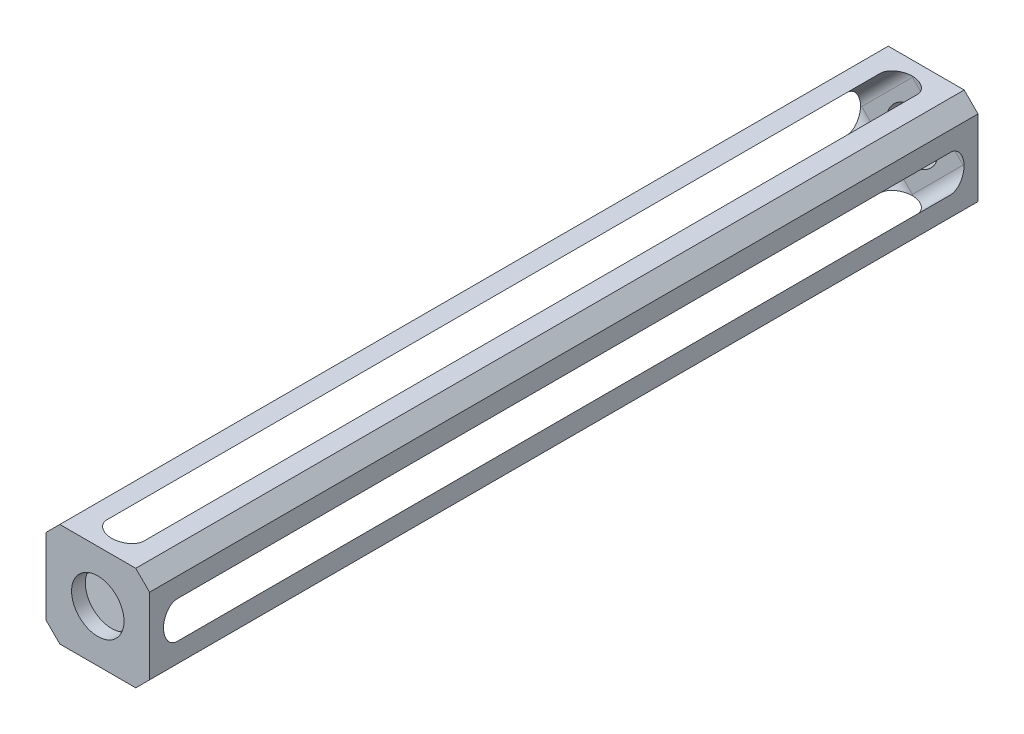
ISO-10303-21;
HEADER;
FILE_DESCRIPTION(('STEP AP214'),'2;1');
FILE_NAME('part.step','',(''),(''),'','','');
FILE_SCHEMA(('AUTOMOTIVE_DESIGN { 1 0 10303 214 1 1 1 1 }'));
ENDSEC;
DATA;
#1=APPLICATION_CONTEXT('core data for automotive mechanical design processes');
#2=APPLICATION_PROTOCOL_DEFINITION('international standard','automotive_design',2000,#1);
#3=PRODUCT_CONTEXT('',#1,'mechanical');
#4=PRODUCT('Part','Part','',(#3));
#5=PRODUCT_RELATED_PRODUCT_CATEGORY('part','',(#4));
#6=PRODUCT_DEFINITION_FORMATION('','',#4);
#7=PRODUCT_DEFINITION_CONTEXT('part definition',#1,'design');
#8=PRODUCT_DEFINITION('design','',#6,#7);
#9=PRODUCT_DEFINITION_SHAPE('','',#8);
#10=(LENGTH_UNIT() NAMED_UNIT(*) SI_UNIT(.MILLI.,.METRE.));
#11=(NAMED_UNIT(*) PLANE_ANGLE_UNIT() SI_UNIT($,.RADIAN.));
#12=(NAMED_UNIT(*) SI_UNIT($,.STERADIAN.) SOLID_ANGLE_UNIT());
#13=UNCERTAINTY_MEASURE_WITH_UNIT(LENGTH_MEASURE(1.E-05),#10,'distance_accuracy_value','');
#14=(GEOMETRIC_REPRESENTATION_CONTEXT(3) GLOBAL_UNCERTAINTY_ASSIGNED_CONTEXT((#13)) GLOBAL_UNIT_ASSIGNED_CONTEXT((#10,
#11,#12)) REPRESENTATION_CONTEXT('',''));
#15=CARTESIAN_POINT('',(0.,0.,0.));
#16=DIRECTION('',(0.,0.,1.));
#17=DIRECTION('',(1.,0.,0.));
#18=AXIS2_PLACEMENT_3D('',#15,#16,#17);
#19=CARTESIAN_POINT('',(-9.525,9.525,76.2));
#20=DIRECTION('',(0.,-1.,0.));
#21=DIRECTION('',(0.,0.,-1.));
#22=AXIS2_PLACEMENT_3D('',#19,#20,#21);
#23=PLANE('',#22);
#24=DIRECTION('',(-1.,0.,0.));
#25=VECTOR('',#24,1.);
#26=CARTESIAN_POINT('',(-9.525,9.525,-76.2));
#27=LINE('',#26,#25);
#28=CARTESIAN_POINT('',(6.98499999999999,9.525,-76.2));
#29=VERTEX_POINT('',#28);
#30=CARTESIAN_POINT('',(-6.98499999999999,9.525,-76.2));
#31=VERTEX_POINT('',#30);
#32=EDGE_CURVE('E235',#29,#31,#27,.T.);
#33=ORIENTED_EDGE('',*,*,#32,.T.);
#34=DIRECTION('',(0.,0.,1.));
#35=VECTOR('',#34,1.);
#36=CARTESIAN_POINT('',(-6.98499999999999,9.525,76.2));
#37=LINE('',#36,#35);
#38=CARTESIAN_POINT('',(-6.98499999999999,9.525,76.2));
#39=VERTEX_POINT('',#38);
#40=EDGE_CURVE('E263',#31,#39,#37,.T.);
#41=ORIENTED_EDGE('',*,*,#40,.T.);
#42=DIRECTION('',(-1.,0.,0.));
#43=VECTOR('',#42,1.);
#44=CARTESIAN_POINT('',(-9.525,9.525,76.2));
#45=LINE('',#44,#43);
#46=CARTESIAN_POINT('',(6.98499999999999,9.525,76.2));
#47=VERTEX_POINT('',#46);
#48=EDGE_CURVE('E233',#47,#39,#45,.T.);
#49=ORIENTED_EDGE('',*,*,#48,.F.);
#50=DIRECTION('',(0.,0.,-1.));
#51=VECTOR('',#50,1.);
#52=CARTESIAN_POINT('',(6.985,9.525,76.2));
#53=LINE('',#52,#51);
#54=EDGE_CURVE('E260',#47,#29,#53,.T.);
#55=ORIENTED_EDGE('',*,*,#54,.T.);
#56=EDGE_LOOP('',(#33,#41,#49,#55));
#57=FACE_BOUND('',#56,.T.);
#58=DIRECTION('',(0.,0.,-1.));
#59=VECTOR('',#58,1.);
#60=CARTESIAN_POINT('',(-3.39289755157231,9.525,76.2));
#61=LINE('',#60,#59);
#62=CARTESIAN_POINT('',(-3.39289755157231,9.525,-71.12));
#63=VERTEX_POINT('',#62);
#64=CARTESIAN_POINT('',(-3.39289755157231,9.525,71.12));
#65=VERTEX_POINT('',#64);
#66=EDGE_CURVE('E401',#63,#65,#61,.F.);
#67=ORIENTED_EDGE('',*,*,#66,.F.);
#68=CARTESIAN_POINT('',(0.199204896855358,9.525,-71.12));
#69=DIRECTION('',(0.,-1.,0.));
#70=DIRECTION('',(-1.,0.,0.));
#71=AXIS2_PLACEMENT_3D('',#68,#69,#70);
#72=ELLIPSE('',#71,3.59210244842767,2.54);
#73=CARTESIAN_POINT('',(0.,9.525,-73.6560912255939));
#74=VERTEX_POINT('',#73);
#75=EDGE_CURVE('E64',#63,#74,#72,.T.);
#76=ORIENTED_EDGE('',*,*,#75,.T.);
#77=CARTESIAN_POINT('',(-0.199204896855304,9.525,-71.12));
#78=DIRECTION('',(0.,-1.,0.));
#79=DIRECTION('',(-1.,0.,0.));
#80=AXIS2_PLACEMENT_3D('',#77,#78,#79);
#81=ELLIPSE('',#80,3.59210244842765,2.54);
#82=CARTESIAN_POINT('',(3.39289755157235,9.525,-71.12));
#83=VERTEX_POINT('',#82);
#84=EDGE_CURVE('E323',#74,#83,#81,.T.);
#85=ORIENTED_EDGE('',*,*,#84,.T.);
#86=DIRECTION('',(0.,0.,1.));
#87=VECTOR('',#86,1.);
#88=CARTESIAN_POINT('',(3.39289755157235,9.525,76.2));
#89=LINE('',#88,#87);
#90=CARTESIAN_POINT('',(3.39289755157235,9.525,71.12));
#91=VERTEX_POINT('',#90);
#92=EDGE_CURVE('E395',#91,#83,#89,.F.);
#93=ORIENTED_EDGE('',*,*,#92,.F.);
#94=CARTESIAN_POINT('',(-0.199204896855304,9.525,71.12));
#95=DIRECTION('',(0.,-1.,0.));
#96=DIRECTION('',(-1.,0.,0.));
#97=AXIS2_PLACEMENT_3D('',#94,#95,#96);
#98=ELLIPSE('',#97,3.59210244842765,2.54);
#99=CARTESIAN_POINT('',(0.,9.525,73.6560912255939));
#100=VERTEX_POINT('',#99);
#101=EDGE_CURVE('E305',#91,#100,#98,.T.);
#102=ORIENTED_EDGE('',*,*,#101,.T.);
#103=CARTESIAN_POINT('',(0.199204896855358,9.525,71.12));
#104=DIRECTION('',(0.,-1.,0.));
#105=DIRECTION('',(-1.,0.,0.));
#106=AXIS2_PLACEMENT_3D('',#103,#104,#105);
#107=ELLIPSE('',#106,3.59210244842767,2.54);
#108=EDGE_CURVE('E303',#100,#65,#107,.T.);
#109=ORIENTED_EDGE('',*,*,#108,.T.);
#110=EDGE_LOOP('',(#67,#76,#85,#93,#102,#109));
#111=FACE_BOUND('',#110,.T.);
#112=ADVANCED_FACE('F40',(#57,#111),#23,.F.);
#113=CARTESIAN_POINT('',(-9.525,9.525,76.2));
#114=DIRECTION('',(1.,0.,0.));
#115=DIRECTION('',(0.,0.,-1.));
#116=AXIS2_PLACEMENT_3D('',#113,#114,#115);
#117=PLANE('',#116);
#118=DIRECTION('',(0.,-1.,0.));
#119=VECTOR('',#118,1.);
#120=CARTESIAN_POINT('',(-9.525,9.525,-76.2));
#121=LINE('',#120,#119);
#122=CARTESIAN_POINT('',(-9.525,6.985,-76.2));
#123=VERTEX_POINT('',#122);
#124=CARTESIAN_POINT('',(-9.525,-6.98499999999996,-76.2));
#125=VERTEX_POINT('',#124);
#126=EDGE_CURVE('E230',#123,#125,#121,.T.);
#127=ORIENTED_EDGE('',*,*,#126,.T.);
#128=DIRECTION('',(0.,0.,1.));
#129=VECTOR('',#128,1.);
#130=CARTESIAN_POINT('',(-9.525,-6.98499999999997,76.2));
#131=LINE('',#130,#129);
#132=CARTESIAN_POINT('',(-9.525,-6.98499999999996,76.2));
#133=VERTEX_POINT('',#132);
#134=EDGE_CURVE('E208',#125,#133,#131,.T.);
#135=ORIENTED_EDGE('',*,*,#134,.T.);
#136=DIRECTION('',(0.,-1.,0.));
#137=VECTOR('',#136,1.);
#138=CARTESIAN_POINT('',(-9.525,9.525,76.2));
#139=LINE('',#138,#137);
#140=CARTESIAN_POINT('',(-9.525,6.985,76.2));
#141=VERTEX_POINT('',#140);
#142=EDGE_CURVE('E407',#141,#133,#139,.T.);
#143=ORIENTED_EDGE('',*,*,#142,.F.);
#144=DIRECTION('',(0.,0.,-1.));
#145=VECTOR('',#144,1.);
#146=CARTESIAN_POINT('',(-9.525,6.985,76.2));
#147=LINE('',#146,#145);
#148=EDGE_CURVE('E213',#141,#123,#147,.T.);
#149=ORIENTED_EDGE('',*,*,#148,.T.);
#150=EDGE_LOOP('',(#127,#135,#143,#149));
#151=FACE_BOUND('',#150,.T.);
#152=DIRECTION('',(0.,0.,-1.));
#153=VECTOR('',#152,1.);
#154=CARTESIAN_POINT('',(-9.525,-3.3928975515723,76.2));
#155=LINE('',#154,#153);
#156=CARTESIAN_POINT('',(-9.525,-3.3928975515723,-71.12));
#157=VERTEX_POINT('',#156);
#158=CARTESIAN_POINT('',(-9.525,-3.3928975515723,71.12));
#159=VERTEX_POINT('',#158);
#160=EDGE_CURVE('E386',#157,#159,#155,.F.);
#161=ORIENTED_EDGE('',*,*,#160,.F.);
#162=CARTESIAN_POINT('',(-9.525,0.199204896855371,-71.12));
#163=DIRECTION('',(1.,0.,0.));
#164=DIRECTION('',(0.,-1.,0.));
#165=AXIS2_PLACEMENT_3D('',#162,#163,#164);
#166=ELLIPSE('',#165,3.59210244842767,2.54);
#167=CARTESIAN_POINT('',(-9.525,0.,-73.6560912255939));
#168=VERTEX_POINT('',#167);
#169=EDGE_CURVE('E49',#157,#168,#166,.T.);
#170=ORIENTED_EDGE('',*,*,#169,.T.);
#171=CARTESIAN_POINT('',(-9.525,-0.199204896855302,-71.12));
#172=DIRECTION('',(1.,0.,0.));
#173=DIRECTION('',(0.,-1.,0.));
#174=AXIS2_PLACEMENT_3D('',#171,#172,#173);
#175=ELLIPSE('',#174,3.59210244842765,2.54);
#176=CARTESIAN_POINT('',(-9.525,3.39289755157235,-71.12));
#177=VERTEX_POINT('',#176);
#178=EDGE_CURVE('E326',#168,#177,#175,.T.);
#179=ORIENTED_EDGE('',*,*,#178,.T.);
#180=DIRECTION('',(0.,0.,1.));
#181=VECTOR('',#180,1.);
#182=CARTESIAN_POINT('',(-9.525,3.39289755157235,76.2));
#183=LINE('',#182,#181);
#184=CARTESIAN_POINT('',(-9.525,3.39289755157235,71.12));
#185=VERTEX_POINT('',#184);
#186=EDGE_CURVE('E383',#185,#177,#183,.F.);
#187=ORIENTED_EDGE('',*,*,#186,.F.);
#188=CARTESIAN_POINT('',(-9.525,-0.199204896855302,71.12));
#189=DIRECTION('',(1.,0.,0.));
#190=DIRECTION('',(0.,-1.,0.));
#191=AXIS2_PLACEMENT_3D('',#188,#189,#190);
#192=ELLIPSE('',#191,3.59210244842765,2.54);
#193=CARTESIAN_POINT('',(-9.525,0.,73.6560912255939));
#194=VERTEX_POINT('',#193);
#195=EDGE_CURVE('E301',#185,#194,#192,.T.);
#196=ORIENTED_EDGE('',*,*,#195,.T.);
#197=CARTESIAN_POINT('',(-9.525,0.199204896855371,71.12));
#198=DIRECTION('',(1.,0.,0.));
#199=DIRECTION('',(0.,-1.,0.));
#200=AXIS2_PLACEMENT_3D('',#197,#198,#199);
#201=ELLIPSE('',#200,3.59210244842767,2.54);
#202=EDGE_CURVE('E315',#194,#159,#201,.T.);
#203=ORIENTED_EDGE('',*,*,#202,.T.);
#204=EDGE_LOOP('',(#161,#170,#179,#187,#196,#203));
#205=FACE_BOUND('',#204,.T.);
#206=ADVANCED_FACE('F426',(#151,#205),#117,.F.);
#207=CARTESIAN_POINT('',(9.525,9.525,76.2));
#208=DIRECTION('',(-1.,0.,0.));
#209=DIRECTION('',(0.,-1.,0.));
#210=AXIS2_PLACEMENT_3D('',#207,#208,#209);
#211=PLANE('',#210);
#212=DIRECTION('',(0.,0.,1.));
#213=VECTOR('',#212,1.);
#214=CARTESIAN_POINT('',(9.525,-3.39289755157233,76.2));
#215=LINE('',#214,#213);
#216=CARTESIAN_POINT('',(9.525,-3.39289755157233,71.12));
#217=VERTEX_POINT('',#216);
#218=CARTESIAN_POINT('',(9.525,-3.39289755157233,-71.12));
#219=VERTEX_POINT('',#218);
#220=EDGE_CURVE('E392',#217,#219,#215,.F.);
#221=ORIENTED_EDGE('',*,*,#220,.F.);
#222=CARTESIAN_POINT('',(9.525,0.199204896855316,71.12));
#223=DIRECTION('',(-1.,0.,0.));
#224=DIRECTION('',(0.,1.,0.));
#225=AXIS2_PLACEMENT_3D('',#222,#223,#224);
#226=ELLIPSE('',#225,3.59210244842765,2.54);
#227=CARTESIAN_POINT('',(9.525,0.,73.6560912255939));
#228=VERTEX_POINT('',#227);
#229=EDGE_CURVE('E309',#217,#228,#226,.T.);
#230=ORIENTED_EDGE('',*,*,#229,.T.);
#231=CARTESIAN_POINT('',(9.525,-0.199204896855358,71.12));
#232=DIRECTION('',(-1.,0.,0.));
#233=DIRECTION('',(0.,1.,0.));
#234=AXIS2_PLACEMENT_3D('',#231,#232,#233);
#235=ELLIPSE('',#234,3.59210244842767,2.54);
#236=CARTESIAN_POINT('',(9.525,3.39289755157232,71.12));
#237=VERTEX_POINT('',#236);
#238=EDGE_CURVE('E307',#228,#237,#235,.T.);
#239=ORIENTED_EDGE('',*,*,#238,.T.);
#240=DIRECTION('',(0.,0.,-1.));
#241=VECTOR('',#240,1.);
#242=CARTESIAN_POINT('',(9.525,3.39289755157232,76.2));
#243=LINE('',#242,#241);
#244=CARTESIAN_POINT('',(9.525,3.39289755157232,-71.12));
#245=VERTEX_POINT('',#244);
#246=EDGE_CURVE('E396',#245,#237,#243,.F.);
#247=ORIENTED_EDGE('',*,*,#246,.F.);
#248=CARTESIAN_POINT('',(9.525,-0.199204896855358,-71.12));
#249=DIRECTION('',(-1.,0.,0.));
#250=DIRECTION('',(0.,1.,0.));
#251=AXIS2_PLACEMENT_3D('',#248,#249,#250);
#252=ELLIPSE('',#251,3.59210244842767,2.54);
#253=CARTESIAN_POINT('',(9.525,0.,-73.6560912255939));
#254=VERTEX_POINT('',#253);
#255=EDGE_CURVE('E321',#245,#254,#252,.T.);
#256=ORIENTED_EDGE('',*,*,#255,.T.);
#257=CARTESIAN_POINT('',(9.525,0.199204896855316,-71.12));
#258=DIRECTION('',(-1.,0.,0.));
#259=DIRECTION('',(0.,1.,0.));
#260=AXIS2_PLACEMENT_3D('',#257,#258,#259);
#261=ELLIPSE('',#260,3.59210244842765,2.54);
#262=EDGE_CURVE('E319',#254,#219,#261,.T.);
#263=ORIENTED_EDGE('',*,*,#262,.T.);
#264=EDGE_LOOP('',(#221,#230,#239,#247,#256,#263));
#265=FACE_BOUND('',#264,.T.);
#266=DIRECTION('',(0.,1.,0.));
#267=VECTOR('',#266,1.);
#268=CARTESIAN_POINT('',(9.525,9.525,76.2));
#269=LINE('',#268,#267);
#270=CARTESIAN_POINT('',(9.525,-6.98499999999998,76.2));
#271=VERTEX_POINT('',#270);
#272=CARTESIAN_POINT('',(9.525,6.98499999999999,76.2));
#273=VERTEX_POINT('',#272);
#274=EDGE_CURVE('E229',#271,#273,#269,.T.);
#275=ORIENTED_EDGE('',*,*,#274,.F.);
#276=DIRECTION('',(0.,0.,-1.));
#277=VECTOR('',#276,1.);
#278=CARTESIAN_POINT('',(9.525,-6.98499999999998,76.2));
#279=LINE('',#278,#277);
#280=CARTESIAN_POINT('',(9.525,-6.98499999999998,-76.2));
#281=VERTEX_POINT('',#280);
#282=EDGE_CURVE('E257',#271,#281,#279,.T.);
#283=ORIENTED_EDGE('',*,*,#282,.T.);
#284=DIRECTION('',(0.,1.,0.));
#285=VECTOR('',#284,1.);
#286=CARTESIAN_POINT('',(9.525,9.525,-76.2));
#287=LINE('',#286,#285);
#288=CARTESIAN_POINT('',(9.525,6.98499999999999,-76.2));
#289=VERTEX_POINT('',#288);
#290=EDGE_CURVE('E403',#281,#289,#287,.T.);
#291=ORIENTED_EDGE('',*,*,#290,.T.);
#292=DIRECTION('',(0.,0.,1.));
#293=VECTOR('',#292,1.);
#294=CARTESIAN_POINT('',(9.525,6.98499999999999,76.2));
#295=LINE('',#294,#293);
#296=EDGE_CURVE('E255',#289,#273,#295,.T.);
#297=ORIENTED_EDGE('',*,*,#296,.T.);
#298=EDGE_LOOP('',(#275,#283,#291,#297));
#299=FACE_BOUND('',#298,.T.);
#300=ADVANCED_FACE('F428',(#265,#299),#211,.F.);
#301=CARTESIAN_POINT('',(-9.525,-9.525,76.2));
#302=DIRECTION('',(0.,1.,0.));
#303=DIRECTION('',(0.,0.,1.));
#304=AXIS2_PLACEMENT_3D('',#301,#302,#303);
#305=PLANE('',#304);
#306=DIRECTION('',(0.,0.,1.));
#307=VECTOR('',#306,1.);
#308=CARTESIAN_POINT('',(-3.39289755157233,-9.525,76.2));
#309=LINE('',#308,#307);
#310=CARTESIAN_POINT('',(-3.39289755157233,-9.525,71.12));
#311=VERTEX_POINT('',#310);
#312=CARTESIAN_POINT('',(-3.39289755157233,-9.525,-71.12));
#313=VERTEX_POINT('',#312);
#314=EDGE_CURVE('E376',#311,#313,#309,.F.);
#315=ORIENTED_EDGE('',*,*,#314,.F.);
#316=CARTESIAN_POINT('',(0.199204896855316,-9.525,71.12));
#317=DIRECTION('',(0.,1.,0.));
#318=DIRECTION('',(1.,0.,0.));
#319=AXIS2_PLACEMENT_3D('',#316,#317,#318);
#320=ELLIPSE('',#319,3.59210244842765,2.54);
#321=CARTESIAN_POINT('',(0.,-9.525,73.6560912255939));
#322=VERTEX_POINT('',#321);
#323=EDGE_CURVE('E313',#311,#322,#320,.T.);
#324=ORIENTED_EDGE('',*,*,#323,.T.);
#325=CARTESIAN_POINT('',(-0.199204896855366,-9.525,71.12));
#326=DIRECTION('',(0.,1.,0.));
#327=DIRECTION('',(1.,0.,0.));
#328=AXIS2_PLACEMENT_3D('',#325,#326,#327);
#329=ELLIPSE('',#328,3.59210244842767,2.54);
#330=CARTESIAN_POINT('',(3.3928975515723,-9.525,71.12));
#331=VERTEX_POINT('',#330);
#332=EDGE_CURVE('E311',#322,#331,#329,.T.);
#333=ORIENTED_EDGE('',*,*,#332,.T.);
#334=DIRECTION('',(0.,0.,-1.));
#335=VECTOR('',#334,1.);
#336=CARTESIAN_POINT('',(3.3928975515723,-9.525,76.2));
#337=LINE('',#336,#335);
#338=CARTESIAN_POINT('',(3.3928975515723,-9.525,-71.12));
#339=VERTEX_POINT('',#338);
#340=EDGE_CURVE('E341',#339,#331,#337,.F.);
#341=ORIENTED_EDGE('',*,*,#340,.F.);
#342=CARTESIAN_POINT('',(-0.199204896855366,-9.525,-71.12));
#343=DIRECTION('',(0.,1.,0.));
#344=DIRECTION('',(1.,0.,0.));
#345=AXIS2_PLACEMENT_3D('',#342,#343,#344);
#346=ELLIPSE('',#345,3.59210244842767,2.54);
#347=CARTESIAN_POINT('',(0.,-9.525,-73.6560912255939));
#348=VERTEX_POINT('',#347);
#349=EDGE_CURVE('E317',#339,#348,#346,.T.);
#350=ORIENTED_EDGE('',*,*,#349,.T.);
#351=CARTESIAN_POINT('',(0.199204896855316,-9.525,-71.12));
#352=DIRECTION('',(0.,1.,0.));
#353=DIRECTION('',(1.,0.,0.));
#354=AXIS2_PLACEMENT_3D('',#351,#352,#353);
#355=ELLIPSE('',#354,3.59210244842765,2.54);
#356=EDGE_CURVE('E11',#348,#313,#355,.T.);
#357=ORIENTED_EDGE('',*,*,#356,.T.);
#358=EDGE_LOOP('',(#315,#324,#333,#341,#350,#357));
#359=FACE_BOUND('',#358,.T.);
#360=DIRECTION('',(1.,0.,0.));
#361=VECTOR('',#360,1.);
#362=CARTESIAN_POINT('',(-9.525,-9.525,76.2));
#363=LINE('',#362,#361);
#364=CARTESIAN_POINT('',(-6.98499999999999,-9.525,76.2));
#365=VERTEX_POINT('',#364);
#366=CARTESIAN_POINT('',(6.98499999999998,-9.525,76.2));
#367=VERTEX_POINT('',#366);
#368=EDGE_CURVE('E223',#365,#367,#363,.T.);
#369=ORIENTED_EDGE('',*,*,#368,.F.);
#370=DIRECTION('',(0.,0.,-1.));
#371=VECTOR('',#370,1.);
#372=CARTESIAN_POINT('',(-6.98499999999999,-9.525,76.2));
#373=LINE('',#372,#371);
#374=CARTESIAN_POINT('',(-6.98499999999999,-9.525,-76.2));
#375=VERTEX_POINT('',#374);
#376=EDGE_CURVE('E207',#365,#375,#373,.T.);
#377=ORIENTED_EDGE('',*,*,#376,.T.);
#378=DIRECTION('',(1.,0.,0.));
#379=VECTOR('',#378,1.);
#380=CARTESIAN_POINT('',(-9.525,-9.525,-76.2));
#381=LINE('',#380,#379);
#382=CARTESIAN_POINT('',(6.98499999999998,-9.525,-76.2));
#383=VERTEX_POINT('',#382);
#384=EDGE_CURVE('E220',#375,#383,#381,.T.);
#385=ORIENTED_EDGE('',*,*,#384,.T.);
#386=DIRECTION('',(0.,0.,1.));
#387=VECTOR('',#386,1.);
#388=CARTESIAN_POINT('',(6.98499999999998,-9.525,76.2));
#389=LINE('',#388,#387);
#390=EDGE_CURVE('E225',#383,#367,#389,.T.);
#391=ORIENTED_EDGE('',*,*,#390,.T.);
#392=EDGE_LOOP('',(#369,#377,#385,#391));
#393=FACE_BOUND('',#392,.T.);
#394=ADVANCED_FACE('F219',(#359,#393),#305,.F.);
#395=CARTESIAN_POINT('',(0.,0.,76.2));
#396=DIRECTION('',(0.,0.,1.));
#397=DIRECTION('',(1.,0.,0.));
#398=AXIS2_PLACEMENT_3D('',#395,#396,#397);
#399=PLANE('',#398);
#400=CARTESIAN_POINT('',(0.,0.,76.2));
#401=DIRECTION('',(0.,0.,1.));
#402=DIRECTION('',(1.,0.,0.));
#403=AXIS2_PLACEMENT_3D('',#400,#401,#402);
#404=CIRCLE('',#403,4.826);
#405=CARTESIAN_POINT('',(4.826,0.,76.2));
#406=VERTEX_POINT('',#405);
#407=EDGE_CURVE('E592',#406,#406,#404,.T.);
#408=ORIENTED_EDGE('',*,*,#407,.F.);
#409=EDGE_LOOP('',(#408));
#410=FACE_BOUND('',#409,.T.);
#411=ORIENTED_EDGE('',*,*,#142,.T.);
#412=DIRECTION('',(-0.707106781186546,0.707106781186549,0.));
#413=VECTOR('',#412,1.);
#414=CARTESIAN_POINT('',(-8.25500000000001,-8.25499999999997,76.2));
#415=LINE('',#414,#413);
#416=EDGE_CURVE('E253',#133,#365,#415,.F.);
#417=ORIENTED_EDGE('',*,*,#416,.T.);
#418=ORIENTED_EDGE('',*,*,#368,.T.);
#419=DIRECTION('',(-0.707106781186549,-0.707106781186546,0.));
#420=VECTOR('',#419,1.);
#421=CARTESIAN_POINT('',(8.25499999999997,-8.25500000000001,76.2));
#422=LINE('',#421,#420);
#423=EDGE_CURVE('E251',#367,#271,#422,.F.);
#424=ORIENTED_EDGE('',*,*,#423,.T.);
#425=ORIENTED_EDGE('',*,*,#274,.T.);
#426=DIRECTION('',(0.707106781186546,-0.70710678118655,0.));
#427=VECTOR('',#426,1.);
#428=CARTESIAN_POINT('',(8.25500000000002,8.25499999999998,76.2));
#429=LINE('',#428,#427);
#430=EDGE_CURVE('E247',#273,#47,#429,.F.);
#431=ORIENTED_EDGE('',*,*,#430,.T.);
#432=ORIENTED_EDGE('',*,*,#48,.T.);
#433=DIRECTION('',(0.70710678118655,0.707106781186546,0.));
#434=VECTOR('',#433,1.);
#435=CARTESIAN_POINT('',(-8.25499999999998,8.25500000000002,76.2));
#436=LINE('',#435,#434);
#437=EDGE_CURVE('E249',#39,#141,#436,.F.);
#438=ORIENTED_EDGE('',*,*,#437,.T.);
#439=EDGE_LOOP('',(#411,#417,#418,#424,#425,#431,#432,#438));
#440=FACE_BOUND('',#439,.T.);
#441=ADVANCED_FACE('F424',(#410,#440),#399,.T.);
#442=CARTESIAN_POINT('',(0.,0.,-76.2));
#443=DIRECTION('',(0.,0.,1.));
#444=DIRECTION('',(1.,0.,0.));
#445=AXIS2_PLACEMENT_3D('',#442,#443,#444);
#446=PLANE('',#445);
#447=CARTESIAN_POINT('',(0.,0.,-76.2));
#448=DIRECTION('',(0.,0.,1.));
#449=DIRECTION('',(1.,0.,0.));
#450=AXIS2_PLACEMENT_3D('',#447,#448,#449);
#451=CIRCLE('',#450,4.826);
#452=CARTESIAN_POINT('',(4.826,0.,-76.2));
#453=VERTEX_POINT('',#452);
#454=EDGE_CURVE('E596',#453,#453,#451,.T.);
#455=ORIENTED_EDGE('',*,*,#454,.T.);
#456=EDGE_LOOP('',(#455));
#457=FACE_BOUND('',#456,.T.);
#458=ORIENTED_EDGE('',*,*,#384,.F.);
#459=DIRECTION('',(0.707106781186546,-0.707106781186549,0.));
#460=VECTOR('',#459,1.);
#461=CARTESIAN_POINT('',(-6.98499999999999,-9.525,-76.2));
#462=LINE('',#461,#460);
#463=EDGE_CURVE('E203',#375,#125,#462,.F.);
#464=ORIENTED_EDGE('',*,*,#463,.T.);
#465=ORIENTED_EDGE('',*,*,#126,.F.);
#466=DIRECTION('',(-0.70710678118655,-0.707106781186546,0.));
#467=VECTOR('',#466,1.);
#468=CARTESIAN_POINT('',(-9.525,6.985,-76.2));
#469=LINE('',#468,#467);
#470=EDGE_CURVE('E241',#123,#31,#469,.F.);
#471=ORIENTED_EDGE('',*,*,#470,.T.);
#472=ORIENTED_EDGE('',*,*,#32,.F.);
#473=DIRECTION('',(-0.707106781186546,0.70710678118655,0.));
#474=VECTOR('',#473,1.);
#475=CARTESIAN_POINT('',(6.985,9.525,-76.2));
#476=LINE('',#475,#474);
#477=EDGE_CURVE('E224',#29,#289,#476,.F.);
#478=ORIENTED_EDGE('',*,*,#477,.T.);
#479=ORIENTED_EDGE('',*,*,#290,.F.);
#480=DIRECTION('',(0.707106781186549,0.707106781186546,0.));
#481=VECTOR('',#480,1.);
#482=CARTESIAN_POINT('',(9.525,-6.98499999999998,-76.2));
#483=LINE('',#482,#481);
#484=EDGE_CURVE('E214',#281,#383,#483,.F.);
#485=ORIENTED_EDGE('',*,*,#484,.T.);
#486=EDGE_LOOP('',(#458,#464,#465,#471,#472,#478,#479,#485));
#487=FACE_BOUND('',#486,.T.);
#488=ADVANCED_FACE('F227',(#457,#487),#446,.F.);
#489=CARTESIAN_POINT('',(-6.98499999999999,-9.525,76.2));
#490=DIRECTION('',(0.707106781186549,0.707106781186545,0.));
#491=DIRECTION('',(0.,0.,-1.));
#492=AXIS2_PLACEMENT_3D('',#489,#490,#491);
#493=PLANE('',#492);
#494=ORIENTED_EDGE('',*,*,#416,.F.);
#495=ORIENTED_EDGE('',*,*,#134,.F.);
#496=ORIENTED_EDGE('',*,*,#463,.F.);
#497=ORIENTED_EDGE('',*,*,#376,.F.);
#498=EDGE_LOOP('',(#494,#495,#496,#497));
#499=FACE_BOUND('',#498,.T.);
#500=ADVANCED_FACE('F206',(#499),#493,.F.);
#501=CARTESIAN_POINT('',(9.525,-6.98499999999998,76.2));
#502=DIRECTION('',(-0.707106781186545,0.707106781186549,0.));
#503=DIRECTION('',(0.,0.,-1.));
#504=AXIS2_PLACEMENT_3D('',#501,#502,#503);
#505=PLANE('',#504);
#506=ORIENTED_EDGE('',*,*,#423,.F.);
#507=ORIENTED_EDGE('',*,*,#390,.F.);
#508=ORIENTED_EDGE('',*,*,#484,.F.);
#509=ORIENTED_EDGE('',*,*,#282,.F.);
#510=EDGE_LOOP('',(#506,#507,#508,#509));
#511=FACE_BOUND('',#510,.T.);
#512=ADVANCED_FACE('F495',(#511),#505,.F.);
#513=CARTESIAN_POINT('',(-9.525,6.985,76.2));
#514=DIRECTION('',(0.707106781186546,-0.70710678118655,0.));
#515=DIRECTION('',(0.,0.,-1.));
#516=AXIS2_PLACEMENT_3D('',#513,#514,#515);
#517=PLANE('',#516);
#518=ORIENTED_EDGE('',*,*,#437,.F.);
#519=ORIENTED_EDGE('',*,*,#40,.F.);
#520=ORIENTED_EDGE('',*,*,#470,.F.);
#521=ORIENTED_EDGE('',*,*,#148,.F.);
#522=EDGE_LOOP('',(#518,#519,#520,#521));
#523=FACE_BOUND('',#522,.T.);
#524=ADVANCED_FACE('F420',(#523),#517,.F.);
#525=CARTESIAN_POINT('',(6.985,9.525,76.2));
#526=DIRECTION('',(-0.70710678118655,-0.707106781186546,0.));
#527=DIRECTION('',(0.,0.,-1.));
#528=AXIS2_PLACEMENT_3D('',#525,#526,#527);
#529=PLANE('',#528);
#530=ORIENTED_EDGE('',*,*,#430,.F.);
#531=ORIENTED_EDGE('',*,*,#296,.F.);
#532=ORIENTED_EDGE('',*,*,#477,.F.);
#533=ORIENTED_EDGE('',*,*,#54,.F.);
#534=EDGE_LOOP('',(#530,#531,#532,#533));
#535=FACE_BOUND('',#534,.T.);
#536=ADVANCED_FACE('F472',(#535),#529,.F.);
#537=CARTESIAN_POINT('',(0.,0.,73.66));
#538=DIRECTION('',(0.,0.,1.));
#539=DIRECTION('',(1.,0.,0.));
#540=AXIS2_PLACEMENT_3D('',#537,#538,#539);
#541=PLANE('',#540);
#542=CARTESIAN_POINT('',(0.,0.,73.66));
#543=DIRECTION('',(0.,0.,1.));
#544=DIRECTION('',(1.,0.,0.));
#545=AXIS2_PLACEMENT_3D('',#542,#543,#544);
#546=CIRCLE('',#545,4.826);
#547=CARTESIAN_POINT('',(4.826,0.,73.66));
#548=VERTEX_POINT('',#547);
#549=EDGE_CURVE('E346',#548,#548,#546,.T.);
#550=ORIENTED_EDGE('',*,*,#549,.T.);
#551=EDGE_LOOP('',(#550));
#552=FACE_BOUND('',#551,.T.);
#553=DIRECTION('',(-0.707106781186546,0.707106781186549,0.));
#554=VECTOR('',#553,1.);
#555=CARTESIAN_POINT('',(-7.72894877578617,-1.59684632735847,73.66));
#556=LINE('',#555,#554);
#557=CARTESIAN_POINT('',(0.,-9.32579510314466,73.66));
#558=VERTEX_POINT('',#557);
#559=CARTESIAN_POINT('',(-9.32579510314466,0.,73.66));
#560=VERTEX_POINT('',#559);
#561=EDGE_CURVE('E270',#558,#560,#556,.T.);
#562=ORIENTED_EDGE('',*,*,#561,.T.);
#563=DIRECTION('',(0.70710678118655,0.707106781186546,0.));
#564=VECTOR('',#563,1.);
#565=CARTESIAN_POINT('',(-1.59684632735849,7.72894877578617,73.66));
#566=LINE('',#565,#564);
#567=CARTESIAN_POINT('',(0.,9.32579510314467,73.66));
#568=VERTEX_POINT('',#567);
#569=EDGE_CURVE('E276',#560,#568,#566,.T.);
#570=ORIENTED_EDGE('',*,*,#569,.T.);
#571=DIRECTION('',(0.707106781186546,-0.70710678118655,0.));
#572=VECTOR('',#571,1.);
#573=CARTESIAN_POINT('',(7.72894877578617,1.59684632735849,73.66));
#574=LINE('',#573,#572);
#575=CARTESIAN_POINT('',(9.32579510314466,0.,73.66));
#576=VERTEX_POINT('',#575);
#577=EDGE_CURVE('E274',#568,#576,#574,.T.);
#578=ORIENTED_EDGE('',*,*,#577,.T.);
#579=DIRECTION('',(-0.707106781186549,-0.707106781186546,0.));
#580=VECTOR('',#579,1.);
#581=CARTESIAN_POINT('',(1.59684632735848,-7.72894877578616,73.66));
#582=LINE('',#581,#580);
#583=EDGE_CURVE('E272',#576,#558,#582,.T.);
#584=ORIENTED_EDGE('',*,*,#583,.T.);
#585=EDGE_LOOP('',(#562,#570,#578,#584));
#586=FACE_BOUND('',#585,.T.);
#587=ADVANCED_FACE('F470',(#552,#586),#541,.F.);
#588=CARTESIAN_POINT('',(0.,0.,-73.66));
#589=DIRECTION('',(0.,0.,1.));
#590=DIRECTION('',(1.,0.,0.));
#591=AXIS2_PLACEMENT_3D('',#588,#589,#590);
#592=PLANE('',#591);
#593=CARTESIAN_POINT('',(0.,0.,-73.66));
#594=DIRECTION('',(0.,0.,1.));
#595=DIRECTION('',(1.,0.,0.));
#596=AXIS2_PLACEMENT_3D('',#593,#594,#595);
#597=CIRCLE('',#596,4.826);
#598=CARTESIAN_POINT('',(4.826,0.,-73.66));
#599=VERTEX_POINT('',#598);
#600=EDGE_CURVE('E44',#599,#599,#597,.T.);
#601=ORIENTED_EDGE('',*,*,#600,.F.);
#602=EDGE_LOOP('',(#601));
#603=FACE_BOUND('',#602,.T.);
#604=DIRECTION('',(0.707106781186546,-0.707106781186549,0.));
#605=VECTOR('',#604,1.);
#606=CARTESIAN_POINT('',(-4.66289755157234,-4.66289755157232,-73.66));
#607=LINE('',#606,#605);
#608=CARTESIAN_POINT('',(-9.32579510314466,0.,-73.66));
#609=VERTEX_POINT('',#608);
#610=CARTESIAN_POINT('',(0.,-9.32579510314466,-73.66));
#611=VERTEX_POINT('',#610);
#612=EDGE_CURVE('E292',#609,#611,#607,.T.);
#613=ORIENTED_EDGE('',*,*,#612,.T.);
#614=DIRECTION('',(0.707106781186549,0.707106781186546,0.));
#615=VECTOR('',#614,1.);
#616=CARTESIAN_POINT('',(4.66289755157232,-4.66289755157234,-73.66));
#617=LINE('',#616,#615);
#618=CARTESIAN_POINT('',(9.32579510314467,0.,-73.66));
#619=VERTEX_POINT('',#618);
#620=EDGE_CURVE('E298',#611,#619,#617,.T.);
#621=ORIENTED_EDGE('',*,*,#620,.T.);
#622=DIRECTION('',(-0.707106781186546,0.70710678118655,0.));
#623=VECTOR('',#622,1.);
#624=CARTESIAN_POINT('',(4.66289755157235,4.66289755157232,-73.66));
#625=LINE('',#624,#623);
#626=CARTESIAN_POINT('',(0.,9.32579510314467,-73.66));
#627=VERTEX_POINT('',#626);
#628=EDGE_CURVE('E296',#619,#627,#625,.T.);
#629=ORIENTED_EDGE('',*,*,#628,.T.);
#630=DIRECTION('',(-0.70710678118655,-0.707106781186546,0.));
#631=VECTOR('',#630,1.);
#632=CARTESIAN_POINT('',(-4.66289755157232,4.66289755157235,-73.66));
#633=LINE('',#632,#631);
#634=EDGE_CURVE('E294',#627,#609,#633,.T.);
#635=ORIENTED_EDGE('',*,*,#634,.T.);
#636=EDGE_LOOP('',(#613,#621,#629,#635));
#637=FACE_BOUND('',#636,.T.);
#638=ADVANCED_FACE('F363',(#603,#637),#592,.T.);
#639=CARTESIAN_POINT('',(-5.18894877578615,-7.72894877578617,76.2));
#640=DIRECTION('',(0.707106781186549,0.707106781186545,0.));
#641=DIRECTION('',(0.,0.,-1.));
#642=AXIS2_PLACEMENT_3D('',#639,#640,#641);
#643=PLANE('',#642);
#644=ORIENTED_EDGE('',*,*,#160,.T.);
#645=DIRECTION('',(0.707106781186546,-0.707106781186549,0.));
#646=VECTOR('',#645,1.);
#647=CARTESIAN_POINT('',(-3.39289755157234,-9.525,71.12));
#648=LINE('',#647,#646);
#649=EDGE_CURVE('E290',#159,#311,#648,.T.);
#650=ORIENTED_EDGE('',*,*,#649,.T.);
#651=ORIENTED_EDGE('',*,*,#314,.T.);
#652=DIRECTION('',(-0.707106781186546,0.707106781186549,0.));
#653=VECTOR('',#652,1.);
#654=CARTESIAN_POINT('',(-5.18894877578615,-7.72894877578617,-71.12));
#655=LINE('',#654,#653);
#656=EDGE_CURVE('E288',#313,#157,#655,.T.);
#657=ORIENTED_EDGE('',*,*,#656,.T.);
#658=EDGE_LOOP('',(#644,#650,#651,#657));
#659=FACE_BOUND('',#658,.T.);
#660=ADVANCED_FACE('F381',(#659),#643,.T.);
#661=CARTESIAN_POINT('',(7.72894877578618,-5.18894877578615,76.2));
#662=DIRECTION('',(-0.707106781186545,0.707106781186549,0.));
#663=DIRECTION('',(0.,0.,-1.));
#664=AXIS2_PLACEMENT_3D('',#661,#662,#663);
#665=PLANE('',#664);
#666=ORIENTED_EDGE('',*,*,#340,.T.);
#667=DIRECTION('',(0.707106781186549,0.707106781186546,0.));
#668=VECTOR('',#667,1.);
#669=CARTESIAN_POINT('',(9.525,-3.39289755157233,71.12));
#670=LINE('',#669,#668);
#671=EDGE_CURVE('E286',#331,#217,#670,.T.);
#672=ORIENTED_EDGE('',*,*,#671,.T.);
#673=ORIENTED_EDGE('',*,*,#220,.T.);
#674=DIRECTION('',(-0.707106781186549,-0.707106781186546,0.));
#675=VECTOR('',#674,1.);
#676=CARTESIAN_POINT('',(7.72894877578618,-5.18894877578615,-71.12));
#677=LINE('',#676,#675);
#678=EDGE_CURVE('E283',#219,#339,#677,.T.);
#679=ORIENTED_EDGE('',*,*,#678,.T.);
#680=EDGE_LOOP('',(#666,#672,#673,#679));
#681=FACE_BOUND('',#680,.T.);
#682=ADVANCED_FACE('F445',(#681),#665,.T.);
#683=CARTESIAN_POINT('',(-7.72894877578617,5.18894877578617,76.2));
#684=DIRECTION('',(0.707106781186546,-0.70710678118655,0.));
#685=DIRECTION('',(0.,0.,-1.));
#686=AXIS2_PLACEMENT_3D('',#683,#684,#685);
#687=PLANE('',#686);
#688=ORIENTED_EDGE('',*,*,#66,.T.);
#689=DIRECTION('',(-0.70710678118655,-0.707106781186546,0.));
#690=VECTOR('',#689,1.);
#691=CARTESIAN_POINT('',(-9.525,3.39289755157235,71.12));
#692=LINE('',#691,#690);
#693=EDGE_CURVE('E267',#65,#185,#692,.T.);
#694=ORIENTED_EDGE('',*,*,#693,.T.);
#695=ORIENTED_EDGE('',*,*,#186,.T.);
#696=DIRECTION('',(0.70710678118655,0.707106781186546,0.));
#697=VECTOR('',#696,1.);
#698=CARTESIAN_POINT('',(-7.72894877578617,5.18894877578617,-71.12));
#699=LINE('',#698,#697);
#700=EDGE_CURVE('E265',#177,#63,#699,.T.);
#701=ORIENTED_EDGE('',*,*,#700,.T.);
#702=EDGE_LOOP('',(#688,#694,#695,#701));
#703=FACE_BOUND('',#702,.T.);
#704=ADVANCED_FACE('F467',(#703),#687,.T.);
#705=CARTESIAN_POINT('',(5.18894877578616,7.72894877578618,76.2));
#706=DIRECTION('',(-0.70710678118655,-0.707106781186546,0.));
#707=DIRECTION('',(0.,0.,-1.));
#708=AXIS2_PLACEMENT_3D('',#705,#706,#707);
#709=PLANE('',#708);
#710=ORIENTED_EDGE('',*,*,#246,.T.);
#711=DIRECTION('',(-0.707106781186546,0.70710678118655,0.));
#712=VECTOR('',#711,1.);
#713=CARTESIAN_POINT('',(3.39289755157235,9.525,71.12));
#714=LINE('',#713,#712);
#715=EDGE_CURVE('E281',#237,#91,#714,.T.);
#716=ORIENTED_EDGE('',*,*,#715,.T.);
#717=ORIENTED_EDGE('',*,*,#92,.T.);
#718=DIRECTION('',(0.707106781186546,-0.70710678118655,0.));
#719=VECTOR('',#718,1.);
#720=CARTESIAN_POINT('',(5.18894877578616,7.72894877578618,-71.12));
#721=LINE('',#720,#719);
#722=EDGE_CURVE('E279',#83,#245,#721,.T.);
#723=ORIENTED_EDGE('',*,*,#722,.T.);
#724=EDGE_LOOP('',(#710,#716,#717,#723));
#725=FACE_BOUND('',#724,.T.);
#726=ADVANCED_FACE('F452',(#725),#709,.T.);
#727=CARTESIAN_POINT('',(5.93289755157235,-3.39289755157231,71.12));
#728=DIRECTION('',(0.707106781186549,0.707106781186546,0.));
#729=DIRECTION('',(-0.707106781186546,0.707106781186549,0.));
#730=AXIS2_PLACEMENT_3D('',#727,#728,#729);
#731=CYLINDRICAL_SURFACE('',#730,2.54);
#732=CARTESIAN_POINT('',(0.,-9.32579510314466,71.12));
#733=DIRECTION('',(1.,0.,0.));
#734=DIRECTION('',(0.,1.,0.));
#735=AXIS2_PLACEMENT_3D('',#732,#733,#734);
#736=ELLIPSE('',#735,3.59210244842766,2.54);
#737=EDGE_CURVE('E335',#558,#322,#736,.T.);
#738=ORIENTED_EDGE('',*,*,#737,.F.);
#739=ORIENTED_EDGE('',*,*,#583,.F.);
#740=CARTESIAN_POINT('',(9.32579510314467,0.,71.12));
#741=DIRECTION('',(0.,1.,0.));
#742=DIRECTION('',(-1.,0.,0.));
#743=AXIS2_PLACEMENT_3D('',#740,#741,#742);
#744=ELLIPSE('',#743,3.59210244842766,2.54);
#745=EDGE_CURVE('E338',#228,#576,#744,.F.);
#746=ORIENTED_EDGE('',*,*,#745,.F.);
#747=ORIENTED_EDGE('',*,*,#229,.F.);
#748=ORIENTED_EDGE('',*,*,#671,.F.);
#749=ORIENTED_EDGE('',*,*,#332,.F.);
#750=EDGE_LOOP('',(#738,#739,#746,#747,#748,#749));
#751=FACE_BOUND('',#750,.T.);
#752=ADVANCED_FACE('F439',(#751),#731,.F.);
#753=CARTESIAN_POINT('',(3.39289755157233,5.93289755157235,71.12));
#754=DIRECTION('',(-0.707106781186546,0.70710678118655,0.));
#755=DIRECTION('',(-0.70710678118655,-0.707106781186546,0.));
#756=AXIS2_PLACEMENT_3D('',#753,#754,#755);
#757=CYLINDRICAL_SURFACE('',#756,2.54);
#758=ORIENTED_EDGE('',*,*,#745,.T.);
#759=ORIENTED_EDGE('',*,*,#577,.F.);
#760=CARTESIAN_POINT('',(0.,9.32579510314467,71.12));
#761=DIRECTION('',(-1.,0.,0.));
#762=DIRECTION('',(0.,-1.,0.));
#763=AXIS2_PLACEMENT_3D('',#760,#761,#762);
#764=ELLIPSE('',#763,3.59210244842766,2.54);
#765=EDGE_CURVE('E332',#100,#568,#764,.F.);
#766=ORIENTED_EDGE('',*,*,#765,.F.);
#767=ORIENTED_EDGE('',*,*,#101,.F.);
#768=ORIENTED_EDGE('',*,*,#715,.F.);
#769=ORIENTED_EDGE('',*,*,#238,.F.);
#770=EDGE_LOOP('',(#758,#759,#766,#767,#768,#769));
#771=FACE_BOUND('',#770,.T.);
#772=ADVANCED_FACE('F458',(#771),#757,.F.);
#773=CARTESIAN_POINT('',(-3.39289755157231,-5.93289755157235,71.12));
#774=DIRECTION('',(0.707106781186546,-0.707106781186549,0.));
#775=DIRECTION('',(0.707106781186549,0.707106781186546,0.));
#776=AXIS2_PLACEMENT_3D('',#773,#774,#775);
#777=CYLINDRICAL_SURFACE('',#776,2.54);
#778=ORIENTED_EDGE('',*,*,#649,.F.);
#779=ORIENTED_EDGE('',*,*,#202,.F.);
#780=CARTESIAN_POINT('',(-9.32579510314466,0.,71.12));
#781=DIRECTION('',(0.,-1.,0.));
#782=DIRECTION('',(1.,0.,0.));
#783=AXIS2_PLACEMENT_3D('',#780,#781,#782);
#784=ELLIPSE('',#783,3.59210244842766,2.54);
#785=EDGE_CURVE('E329',#560,#194,#784,.T.);
#786=ORIENTED_EDGE('',*,*,#785,.F.);
#787=ORIENTED_EDGE('',*,*,#561,.F.);
#788=ORIENTED_EDGE('',*,*,#737,.T.);
#789=ORIENTED_EDGE('',*,*,#323,.F.);
#790=EDGE_LOOP('',(#778,#779,#786,#787,#788,#789));
#791=FACE_BOUND('',#790,.T.);
#792=ADVANCED_FACE('F432',(#791),#777,.F.);
#793=CARTESIAN_POINT('',(-5.93289755157235,3.39289755157233,71.12));
#794=DIRECTION('',(-0.70710678118655,-0.707106781186546,0.));
#795=DIRECTION('',(0.707106781186546,-0.70710678118655,0.));
#796=AXIS2_PLACEMENT_3D('',#793,#794,#795);
#797=CYLINDRICAL_SURFACE('',#796,2.54);
#798=ORIENTED_EDGE('',*,*,#765,.T.);
#799=ORIENTED_EDGE('',*,*,#569,.F.);
#800=ORIENTED_EDGE('',*,*,#785,.T.);
#801=ORIENTED_EDGE('',*,*,#195,.F.);
#802=ORIENTED_EDGE('',*,*,#693,.F.);
#803=ORIENTED_EDGE('',*,*,#108,.F.);
#804=EDGE_LOOP('',(#798,#799,#800,#801,#802,#803));
#805=FACE_BOUND('',#804,.T.);
#806=ADVANCED_FACE('F465',(#805),#797,.F.);
#807=CARTESIAN_POINT('',(-5.93289755157235,3.39289755157233,-71.12));
#808=DIRECTION('',(-0.70710678118655,-0.707106781186546,0.));
#809=DIRECTION('',(0.707106781186546,-0.70710678118655,0.));
#810=AXIS2_PLACEMENT_3D('',#807,#808,#809);
#811=CYLINDRICAL_SURFACE('',#810,2.54);
#812=CARTESIAN_POINT('',(-9.32579510314466,0.,-71.12));
#813=DIRECTION('',(0.,-1.,0.));
#814=DIRECTION('',(-1.,0.,0.));
#815=AXIS2_PLACEMENT_3D('',#812,#813,#814);
#816=ELLIPSE('',#815,3.59210244842766,2.54);
#817=EDGE_CURVE('E348',#609,#168,#816,.F.);
#818=ORIENTED_EDGE('',*,*,#817,.F.);
#819=ORIENTED_EDGE('',*,*,#634,.F.);
#820=CARTESIAN_POINT('',(0.,9.32579510314467,-71.12));
#821=DIRECTION('',(-1.,0.,0.));
#822=DIRECTION('',(0.,1.,0.));
#823=AXIS2_PLACEMENT_3D('',#820,#821,#822);
#824=ELLIPSE('',#823,3.59210244842766,2.54);
#825=EDGE_CURVE('E333',#74,#627,#824,.T.);
#826=ORIENTED_EDGE('',*,*,#825,.F.);
#827=ORIENTED_EDGE('',*,*,#75,.F.);
#828=ORIENTED_EDGE('',*,*,#700,.F.);
#829=ORIENTED_EDGE('',*,*,#178,.F.);
#830=EDGE_LOOP('',(#818,#819,#826,#827,#828,#829));
#831=FACE_BOUND('',#830,.T.);
#832=ADVANCED_FACE('F42',(#831),#811,.F.);
#833=CARTESIAN_POINT('',(3.39289755157233,5.93289755157235,-71.12));
#834=DIRECTION('',(-0.707106781186546,0.70710678118655,0.));
#835=DIRECTION('',(-0.70710678118655,-0.707106781186546,0.));
#836=AXIS2_PLACEMENT_3D('',#833,#834,#835);
#837=CYLINDRICAL_SURFACE('',#836,2.54);
#838=ORIENTED_EDGE('',*,*,#825,.T.);
#839=ORIENTED_EDGE('',*,*,#628,.F.);
#840=CARTESIAN_POINT('',(9.32579510314466,0.,-71.12));
#841=DIRECTION('',(0.,1.,0.));
#842=DIRECTION('',(1.,0.,0.));
#843=AXIS2_PLACEMENT_3D('',#840,#841,#842);
#844=ELLIPSE('',#843,3.59210244842766,2.54);
#845=EDGE_CURVE('E345',#254,#619,#844,.T.);
#846=ORIENTED_EDGE('',*,*,#845,.F.);
#847=ORIENTED_EDGE('',*,*,#255,.F.);
#848=ORIENTED_EDGE('',*,*,#722,.F.);
#849=ORIENTED_EDGE('',*,*,#84,.F.);
#850=EDGE_LOOP('',(#838,#839,#846,#847,#848,#849));
#851=FACE_BOUND('',#850,.T.);
#852=ADVANCED_FACE('F354',(#851),#837,.F.);
#853=CARTESIAN_POINT('',(-3.39289755157231,-5.93289755157235,-71.12));
#854=DIRECTION('',(0.707106781186546,-0.707106781186549,0.));
#855=DIRECTION('',(0.707106781186549,0.707106781186546,0.));
#856=AXIS2_PLACEMENT_3D('',#853,#854,#855);
#857=CYLINDRICAL_SURFACE('',#856,2.54);
#858=ORIENTED_EDGE('',*,*,#656,.F.);
#859=ORIENTED_EDGE('',*,*,#356,.F.);
#860=CARTESIAN_POINT('',(0.,-9.32579510314466,-71.12));
#861=DIRECTION('',(1.,0.,0.));
#862=DIRECTION('',(0.,-1.,0.));
#863=AXIS2_PLACEMENT_3D('',#860,#861,#862);
#864=ELLIPSE('',#863,3.59210244842766,2.54);
#865=EDGE_CURVE('E342',#611,#348,#864,.F.);
#866=ORIENTED_EDGE('',*,*,#865,.F.);
#867=ORIENTED_EDGE('',*,*,#612,.F.);
#868=ORIENTED_EDGE('',*,*,#817,.T.);
#869=ORIENTED_EDGE('',*,*,#169,.F.);
#870=EDGE_LOOP('',(#858,#859,#866,#867,#868,#869));
#871=FACE_BOUND('',#870,.T.);
#872=ADVANCED_FACE('F372',(#871),#857,.F.);
#873=CARTESIAN_POINT('',(5.93289755157235,-3.39289755157231,-71.12));
#874=DIRECTION('',(0.707106781186549,0.707106781186546,0.));
#875=DIRECTION('',(-0.707106781186546,0.707106781186549,0.));
#876=AXIS2_PLACEMENT_3D('',#873,#874,#875);
#877=CYLINDRICAL_SURFACE('',#876,2.54);
#878=ORIENTED_EDGE('',*,*,#845,.T.);
#879=ORIENTED_EDGE('',*,*,#620,.F.);
#880=ORIENTED_EDGE('',*,*,#865,.T.);
#881=ORIENTED_EDGE('',*,*,#349,.F.);
#882=ORIENTED_EDGE('',*,*,#678,.F.);
#883=ORIENTED_EDGE('',*,*,#262,.F.);
#884=EDGE_LOOP('',(#878,#879,#880,#881,#882,#883));
#885=FACE_BOUND('',#884,.T.);
#886=ADVANCED_FACE('F367',(#885),#877,.F.);
#887=CARTESIAN_POINT('',(0.,0.,-76.2));
#888=DIRECTION('',(0.,0.,1.));
#889=DIRECTION('',(1.,0.,0.));
#890=AXIS2_PLACEMENT_3D('',#887,#888,#889);
#891=CYLINDRICAL_SURFACE('',#890,4.826);
#892=CARTESIAN_POINT('',(4.826,0.,-73.66));
#893=CARTESIAN_POINT('',(4.826,0.,-73.6864583333333));
#894=CARTESIAN_POINT('',(4.826,0.,-73.7129166666667));
#895=CARTESIAN_POINT('',(4.826,0.,-73.7658333333333));
#896=CARTESIAN_POINT('',(4.826,0.,-73.7922916666667));
#897=CARTESIAN_POINT('',(4.826,0.,-73.8452083333333));
#898=CARTESIAN_POINT('',(4.826,0.,-73.8716666666667));
#899=CARTESIAN_POINT('',(4.826,0.,-73.9245833333333));
#900=CARTESIAN_POINT('',(4.826,0.,-73.9510416666667));
#901=CARTESIAN_POINT('',(4.826,0.,-74.0039583333333));
#902=CARTESIAN_POINT('',(4.826,0.,-74.0304166666667));
#903=CARTESIAN_POINT('',(4.826,0.,-74.0833333333333));
#904=CARTESIAN_POINT('',(4.826,0.,-74.1097916666667));
#905=CARTESIAN_POINT('',(4.826,0.,-74.1627083333333));
#906=CARTESIAN_POINT('',(4.826,0.,-74.1891666666667));
#907=CARTESIAN_POINT('',(4.826,0.,-74.2420833333333));
#908=CARTESIAN_POINT('',(4.826,0.,-74.2685416666667));
#909=CARTESIAN_POINT('',(4.826,0.,-74.3214583333333));
#910=CARTESIAN_POINT('',(4.826,0.,-74.3479166666667));
#911=CARTESIAN_POINT('',(4.826,0.,-74.4008333333334));
#912=CARTESIAN_POINT('',(4.826,0.,-74.4272916666667));
#913=CARTESIAN_POINT('',(4.826,0.,-74.4802083333333));
#914=CARTESIAN_POINT('',(4.826,0.,-74.5066666666667));
#915=CARTESIAN_POINT('',(4.826,0.,-74.5595833333334));
#916=CARTESIAN_POINT('',(4.826,0.,-74.5860416666667));
#917=CARTESIAN_POINT('',(4.826,0.,-74.6389583333333));
#918=CARTESIAN_POINT('',(4.826,0.,-74.6654166666667));
#919=CARTESIAN_POINT('',(4.826,0.,-74.7183333333333));
#920=CARTESIAN_POINT('',(4.826,0.,-74.7447916666667));
#921=CARTESIAN_POINT('',(4.826,0.,-74.7977083333333));
#922=CARTESIAN_POINT('',(4.826,0.,-74.8241666666667));
#923=CARTESIAN_POINT('',(4.826,0.,-74.8770833333333));
#924=CARTESIAN_POINT('',(4.826,0.,-74.9035416666667));
#925=CARTESIAN_POINT('',(4.826,0.,-74.9564583333333));
#926=CARTESIAN_POINT('',(4.826,0.,-74.9829166666667));
#927=CARTESIAN_POINT('',(4.826,0.,-75.0358333333333));
#928=CARTESIAN_POINT('',(4.826,0.,-75.0622916666667));
#929=CARTESIAN_POINT('',(4.826,0.,-75.1152083333334));
#930=CARTESIAN_POINT('',(4.826,0.,-75.1416666666667));
#931=CARTESIAN_POINT('',(4.826,0.,-75.1945833333333));
#932=CARTESIAN_POINT('',(4.826,0.,-75.2210416666667));
#933=CARTESIAN_POINT('',(4.826,0.,-75.2739583333334));
#934=CARTESIAN_POINT('',(4.826,0.,-75.3004166666667));
#935=CARTESIAN_POINT('',(4.826,0.,-75.3533333333333));
#936=CARTESIAN_POINT('',(4.826,0.,-75.3797916666667));
#937=CARTESIAN_POINT('',(4.826,0.,-75.4327083333334));
#938=CARTESIAN_POINT('',(4.826,0.,-75.4591666666667));
#939=CARTESIAN_POINT('',(4.826,0.,-75.5120833333333));
#940=CARTESIAN_POINT('',(4.826,0.,-75.5385416666667));
#941=CARTESIAN_POINT('',(4.826,0.,-75.5914583333333));
#942=CARTESIAN_POINT('',(4.826,0.,-75.6179166666667));
#943=CARTESIAN_POINT('',(4.826,0.,-75.6708333333333));
#944=CARTESIAN_POINT('',(4.826,0.,-75.6972916666667));
#945=CARTESIAN_POINT('',(4.826,0.,-75.7502083333333));
#946=CARTESIAN_POINT('',(4.826,0.,-75.7766666666667));
#947=CARTESIAN_POINT('',(4.826,0.,-75.8295833333333));
#948=CARTESIAN_POINT('',(4.826,0.,-75.8560416666667));
#949=CARTESIAN_POINT('',(4.826,0.,-75.9089583333333));
#950=CARTESIAN_POINT('',(4.826,0.,-75.9354166666667));
#951=CARTESIAN_POINT('',(4.826,0.,-75.9883333333333));
#952=CARTESIAN_POINT('',(4.826,0.,-76.0147916666667));
#953=CARTESIAN_POINT('',(4.826,0.,-76.0677083333333));
#954=CARTESIAN_POINT('',(4.826,0.,-76.0941666666667));
#955=CARTESIAN_POINT('',(4.826,0.,-76.1470833333333));
#956=CARTESIAN_POINT('',(4.826,0.,-76.1735416666667));
#957=CARTESIAN_POINT('',(4.826,0.,-76.2));
#958=B_SPLINE_CURVE_WITH_KNOTS('',3,(#892,#893,#894,#895,#896,#897,#898,#899,#900,#901,#902,
#903,#904,#905,#906,#907,#908,#909,#910,#911,#912,#913,#914,#915,#916,#917,#918,#919,#920,#921,
#922,#923,#924,#925,#926,#927,#928,#929,#930,#931,#932,#933,#934,#935,#936,#937,#938,#939,#940,
#941,#942,#943,#944,#945,#946,#947,#948,#949,#950,#951,#952,#953,#954,#955,#956,#957),
.UNSPECIFIED.,.F.,.F.,(4,2,2,2,2,2,2,2,2,2,2,2,2,2,2,2,2,2,2,2,2,2,2,2,2,2,2,2,2,2,2,2,4),(0.,
0.0793749999999926,0.158749999999999,0.238124999999992,0.317499999999998,0.396874999999991,
0.476249999999998,0.55562499999999,0.634999999999997,0.714374999999989,0.793749999999996,
0.873124999999988,0.952499999999995,1.03187499999999,1.11124999999999,1.19062499999999,
1.26999999999999,1.349375,1.42874999999999,1.508125,1.58749999999999,1.666875,1.74624999999999,
1.825625,1.90499999999999,1.984375,2.06374999999999,2.143125,2.22249999999999,2.301875,
2.38124999999999,2.46062499999999,2.53999999999999),.UNSPECIFIED.);
#959=EDGE_CURVE('BSEAM511',#599,#453,#958,.T.);
#960=ORIENTED_EDGE('',*,*,#600,.T.);
#961=ORIENTED_EDGE('',*,*,#454,.F.);
#962=ORIENTED_EDGE('',*,*,#959,.T.);
#963=ORIENTED_EDGE('',*,*,#959,.F.);
#964=EDGE_LOOP('',(#960,#962,#961,#963));
#965=FACE_BOUND('',#964,.T.);
#966=ADVANCED_FACE('F511',(#965),#891,.F.);
#967=CARTESIAN_POINT('',(4.826,0.,76.2));
#968=CARTESIAN_POINT('',(4.826,0.,76.1735416666667));
#969=CARTESIAN_POINT('',(4.826,0.,76.1470833333333));
#970=CARTESIAN_POINT('',(4.826,0.,76.0941666666667));
#971=CARTESIAN_POINT('',(4.826,0.,76.0677083333333));
#972=CARTESIAN_POINT('',(4.826,0.,76.0147916666667));
#973=CARTESIAN_POINT('',(4.826,0.,75.9883333333333));
#974=CARTESIAN_POINT('',(4.826,0.,75.9354166666667));
#975=CARTESIAN_POINT('',(4.826,0.,75.9089583333333));
#976=CARTESIAN_POINT('',(4.826,0.,75.8560416666667));
#977=CARTESIAN_POINT('',(4.826,0.,75.8295833333333));
#978=CARTESIAN_POINT('',(4.826,0.,75.7766666666667));
#979=CARTESIAN_POINT('',(4.826,0.,75.7502083333333));
#980=CARTESIAN_POINT('',(4.826,0.,75.6972916666667));
#981=CARTESIAN_POINT('',(4.826,0.,75.6708333333333));
#982=CARTESIAN_POINT('',(4.826,0.,75.6179166666667));
#983=CARTESIAN_POINT('',(4.826,0.,75.5914583333333));
#984=CARTESIAN_POINT('',(4.826,0.,75.5385416666667));
#985=CARTESIAN_POINT('',(4.826,0.,75.5120833333333));
#986=CARTESIAN_POINT('',(4.826,0.,75.4591666666667));
#987=CARTESIAN_POINT('',(4.826,0.,75.4327083333333));
#988=CARTESIAN_POINT('',(4.826,0.,75.3797916666667));
#989=CARTESIAN_POINT('',(4.826,0.,75.3533333333333));
#990=CARTESIAN_POINT('',(4.826,0.,75.3004166666667));
#991=CARTESIAN_POINT('',(4.826,0.,75.2739583333333));
#992=CARTESIAN_POINT('',(4.826,0.,75.2210416666667));
#993=CARTESIAN_POINT('',(4.826,0.,75.1945833333333));
#994=CARTESIAN_POINT('',(4.826,0.,75.1416666666667));
#995=CARTESIAN_POINT('',(4.826,0.,75.1152083333333));
#996=CARTESIAN_POINT('',(4.826,0.,75.0622916666667));
#997=CARTESIAN_POINT('',(4.826,0.,75.0358333333333));
#998=CARTESIAN_POINT('',(4.826,0.,74.9829166666667));
#999=CARTESIAN_POINT('',(4.826,0.,74.9564583333333));
#1000=CARTESIAN_POINT('',(4.826,0.,74.9035416666667));
#1001=CARTESIAN_POINT('',(4.826,0.,74.8770833333333));
#1002=CARTESIAN_POINT('',(4.826,0.,74.8241666666667));
#1003=CARTESIAN_POINT('',(4.826,0.,74.7977083333333));
#1004=CARTESIAN_POINT('',(4.826,0.,74.7447916666666));
#1005=CARTESIAN_POINT('',(4.826,0.,74.7183333333333));
#1006=CARTESIAN_POINT('',(4.826,0.,74.6654166666666));
#1007=CARTESIAN_POINT('',(4.826,0.,74.6389583333333));
#1008=CARTESIAN_POINT('',(4.826,0.,74.5860416666666));
#1009=CARTESIAN_POINT('',(4.826,0.,74.5595833333333));
#1010=CARTESIAN_POINT('',(4.826,0.,74.5066666666666));
#1011=CARTESIAN_POINT('',(4.826,0.,74.4802083333333));
#1012=CARTESIAN_POINT('',(4.826,0.,74.4272916666666));
#1013=CARTESIAN_POINT('',(4.826,0.,74.4008333333333));
#1014=CARTESIAN_POINT('',(4.826,0.,74.3479166666666));
#1015=CARTESIAN_POINT('',(4.826,0.,74.3214583333333));
#1016=CARTESIAN_POINT('',(4.826,0.,74.2685416666666));
#1017=CARTESIAN_POINT('',(4.826,0.,74.2420833333333));
#1018=CARTESIAN_POINT('',(4.826,0.,74.1891666666666));
#1019=CARTESIAN_POINT('',(4.826,0.,74.1627083333333));
#1020=CARTESIAN_POINT('',(4.826,0.,74.1097916666667));
#1021=CARTESIAN_POINT('',(4.826,0.,74.0833333333333));
#1022=CARTESIAN_POINT('',(4.826,0.,74.0304166666666));
#1023=CARTESIAN_POINT('',(4.826,0.,74.0039583333333));
#1024=CARTESIAN_POINT('',(4.826,0.,73.9510416666666));
#1025=CARTESIAN_POINT('',(4.826,0.,73.9245833333333));
#1026=CARTESIAN_POINT('',(4.826,0.,73.8716666666666));
#1027=CARTESIAN_POINT('',(4.826,0.,73.8452083333333));
#1028=CARTESIAN_POINT('',(4.826,0.,73.7922916666666));
#1029=CARTESIAN_POINT('',(4.826,0.,73.7658333333333));
#1030=CARTESIAN_POINT('',(4.826,0.,73.7129166666666));
#1031=CARTESIAN_POINT('',(4.826,0.,73.6864583333333));
#1032=CARTESIAN_POINT('',(4.826,0.,73.66));
#1033=B_SPLINE_CURVE_WITH_KNOTS('',3,(#967,#968,#969,#970,#971,#972,#973,#974,#975,#976,#977,
#978,#979,#980,#981,#982,#983,#984,#985,#986,#987,#988,#989,#990,#991,#992,#993,#994,#995,#996,
#997,#998,#999,#1000,#1001,#1002,#1003,#1004,#1005,#1006,#1007,#1008,#1009,#1010,#1011,#1012,
#1013,#1014,#1015,#1016,#1017,#1018,#1019,#1020,#1021,#1022,#1023,#1024,#1025,#1026,#1027,#1028,
#1029,#1030,#1031,#1032),.UNSPECIFIED.,.F.,.F.,(4,2,2,2,2,2,2,2,2,2,2,2,2,2,2,2,2,2,2,2,2,2,2,2,
2,2,2,2,2,2,2,2,4),(0.,0.0793749999999926,0.158750000000013,0.238125000000006,0.317499999999998,
0.396875000000019,0.476250000000011,0.555625000000004,0.634999999999997,0.714375000000017,
0.79375000000001,0.873125000000002,0.952500000000023,1.03187500000002,1.11125000000001,
1.19062500000003,1.27000000000002,1.34937500000001,1.42875000000003,1.50812500000003,
1.58750000000002,1.66687500000004,1.74625000000003,1.82562500000003,1.90500000000005,
1.98437500000004,2.06375000000003,2.14312500000002,2.22250000000004,2.30187500000004,
2.38125000000003,2.46062500000005,2.54000000000004),.UNSPECIFIED.);
#1034=EDGE_CURVE('BSEAM576',#406,#548,#1033,.T.);
#1035=ORIENTED_EDGE('',*,*,#407,.T.);
#1036=ORIENTED_EDGE('',*,*,#549,.F.);
#1037=ORIENTED_EDGE('',*,*,#1034,.T.);
#1038=ORIENTED_EDGE('',*,*,#1034,.F.);
#1039=EDGE_LOOP('',(#1035,#1037,#1036,#1038));
#1040=FACE_BOUND('',#1039,.T.);
#1041=ADVANCED_FACE('F576',(#1040),#891,.F.);
#1042=CLOSED_SHELL('',(#112,#206,#300,#394,#441,#488,#500,#512,#524,#536,#587,#638,#660,#682,
#704,#726,#752,#772,#792,#806,#832,#852,#872,#886,#966,#1041));
#1043=MANIFOLD_SOLID_BREP('B2',#1042);
#1044=ADVANCED_BREP_SHAPE_REPRESENTATION('',(#18,#1043),#14);
#1045=SHAPE_DEFINITION_REPRESENTATION(#9,#1044);
ENDSEC;
END-ISO-10303-21;
